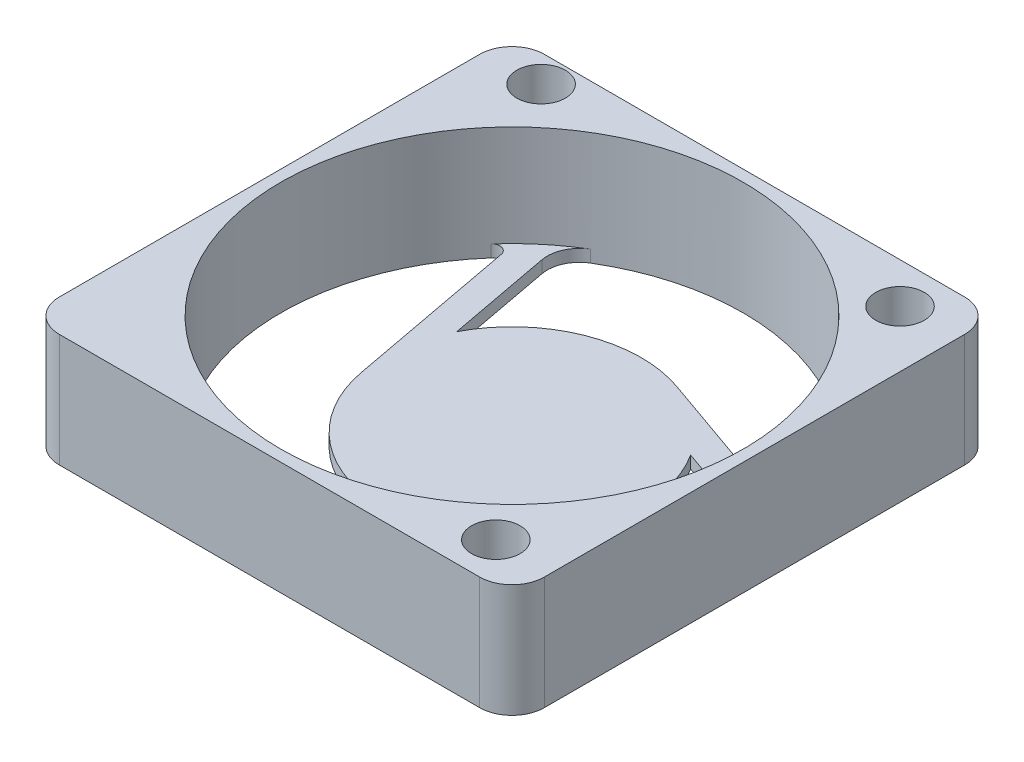
ISO-10303-21;
HEADER;
FILE_DESCRIPTION(('STEP AP214'),'2;1');
FILE_NAME('part.step','',(''),(''),'','','');
FILE_SCHEMA(('AUTOMOTIVE_DESIGN { 1 0 10303 214 1 1 1 1 }'));
ENDSEC;
DATA;
#1=APPLICATION_CONTEXT('core data for automotive mechanical design processes');
#2=APPLICATION_PROTOCOL_DEFINITION('international standard','automotive_design',2000,#1);
#3=PRODUCT_CONTEXT('',#1,'mechanical');
#4=PRODUCT('Part','Part','',(#3));
#5=PRODUCT_RELATED_PRODUCT_CATEGORY('part','',(#4));
#6=PRODUCT_DEFINITION_FORMATION('','',#4);
#7=PRODUCT_DEFINITION_CONTEXT('part definition',#1,'design');
#8=PRODUCT_DEFINITION('design','',#6,#7);
#9=PRODUCT_DEFINITION_SHAPE('','',#8);
#10=(LENGTH_UNIT() NAMED_UNIT(*) SI_UNIT(.MILLI.,.METRE.));
#11=(NAMED_UNIT(*) PLANE_ANGLE_UNIT() SI_UNIT($,.RADIAN.));
#12=(NAMED_UNIT(*) SI_UNIT($,.STERADIAN.) SOLID_ANGLE_UNIT());
#13=UNCERTAINTY_MEASURE_WITH_UNIT(LENGTH_MEASURE(1.E-05),#10,'distance_accuracy_value','');
#14=(GEOMETRIC_REPRESENTATION_CONTEXT(3) GLOBAL_UNCERTAINTY_ASSIGNED_CONTEXT((#13)) GLOBAL_UNIT_ASSIGNED_CONTEXT((#10,
#11,#12)) REPRESENTATION_CONTEXT('',''));
#15=CARTESIAN_POINT('',(0.,0.,0.));
#16=DIRECTION('',(0.,0.,1.));
#17=DIRECTION('',(1.,0.,0.));
#18=AXIS2_PLACEMENT_3D('',#15,#16,#17);
#19=CARTESIAN_POINT('',(13.,0.,13.));
#20=DIRECTION('',(0.,1.,0.));
#21=DIRECTION('',(0.,0.,1.));
#22=AXIS2_PLACEMENT_3D('',#19,#20,#21);
#23=PLANE('',#22);
#24=CARTESIAN_POINT('',(0.,0.,0.));
#25=DIRECTION('',(0.,1.,0.));
#26=DIRECTION('',(0.,0.,1.));
#27=AXIS2_PLACEMENT_3D('',#24,#25,#26);
#28=CIRCLE('',#27,8.);
#29=CARTESIAN_POINT('',(6.74049606659327,0.,-4.30879481714326));
#30=VERTEX_POINT('',#29);
#31=CARTESIAN_POINT('',(5.2099932184376,0.,6.0709118478069));
#32=VERTEX_POINT('',#31);
#33=EDGE_CURVE('E304',#30,#32,#28,.F.);
#34=ORIENTED_EDGE('',*,*,#33,.T.);
#35=DIRECTION('',(0.758863980975885,0.,-0.651249152304578));
#36=VECTOR('',#35,1.);
#37=CARTESIAN_POINT('',(5.20999321843695,0.,6.07091184780746));
#38=LINE('',#37,#36);
#39=CARTESIAN_POINT('',(-3.0400135739461,0.,13.1509816162225));
#40=VERTEX_POINT('',#39);
#41=EDGE_CURVE('E281',#40,#32,#38,.T.);
#42=ORIENTED_EDGE('',*,*,#41,.F.);
#43=CARTESIAN_POINT('',(-2.71438899779381,0.,13.5304136067105));
#44=DIRECTION('',(0.,1.,0.));
#45=DIRECTION('',(0.,0.,1.));
#46=AXIS2_PLACEMENT_3D('',#43,#44,#45);
#47=CIRCLE('',#46,0.5);
#48=CARTESIAN_POINT('',(-2.81273642525011,0.,14.0206459837652));
#49=VERTEX_POINT('',#48);
#50=EDGE_CURVE('E12',#40,#49,#47,.T.);
#51=ORIENTED_EDGE('',*,*,#50,.T.);
#52=CARTESIAN_POINT('',(0.,0.,0.));
#53=DIRECTION('',(0.,1.,0.));
#54=DIRECTION('',(0.,0.,1.));
#55=AXIS2_PLACEMENT_3D('',#52,#53,#54);
#56=CIRCLE('',#55,14.3);
#57=CARTESIAN_POINT('',(14.297372810482,0.,-0.274099832340589));
#58=VERTEX_POINT('',#57);
#59=EDGE_CURVE('E300',#58,#49,#56,.F.);
#60=ORIENTED_EDGE('',*,*,#59,.F.);
#61=CARTESIAN_POINT('',(12.2977402495755,0.,-0.235764191453794));
#62=DIRECTION('',(0.,1.,0.));
#63=DIRECTION('',(0.,0.,1.));
#64=AXIS2_PLACEMENT_3D('',#61,#62,#63);
#65=CIRCLE('',#64,2.);
#66=CARTESIAN_POINT('',(12.9608820683551,0.,-2.12262479260737));
#67=VERTEX_POINT('',#66);
#68=EDGE_CURVE('E463',#58,#67,#65,.T.);
#69=ORIENTED_EDGE('',*,*,#68,.T.);
#70=DIRECTION('',(0.943430300576788,0.,0.331570909389818));
#71=VECTOR('',#70,1.);
#72=CARTESIAN_POINT('',(2.08889672915586,0.,-5.94361089363377));
#73=LINE('',#72,#71);
#74=EDGE_CURVE('E651',#30,#67,#73,.T.);
#75=ORIENTED_EDGE('',*,*,#74,.F.);
#76=EDGE_LOOP('',(#34,#42,#51,#60,#69,#75));
#77=FACE_BOUND('',#76,.T.);
#78=CARTESIAN_POINT('',(11.5,0.,12.5));
#79=DIRECTION('',(0.,1.,0.));
#80=DIRECTION('',(0.,0.,-1.));
#81=AXIS2_PLACEMENT_3D('',#78,#79,#80);
#82=CIRCLE('',#81,1.5);
#83=CARTESIAN_POINT('',(11.5,0.,11.));
#84=VERTEX_POINT('',#83);
#85=EDGE_CURVE('E355',#84,#84,#82,.T.);
#86=ORIENTED_EDGE('',*,*,#85,.T.);
#87=EDGE_LOOP('',(#86));
#88=FACE_BOUND('',#87,.T.);
#89=CARTESIAN_POINT('',(11.5,0.,-12.5));
#90=DIRECTION('',(0.,1.,0.));
#91=DIRECTION('',(0.,0.,1.));
#92=AXIS2_PLACEMENT_3D('',#89,#90,#91);
#93=CIRCLE('',#92,1.5);
#94=CARTESIAN_POINT('',(11.5,0.,-11.));
#95=VERTEX_POINT('',#94);
#96=EDGE_CURVE('E363',#95,#95,#93,.T.);
#97=ORIENTED_EDGE('',*,*,#96,.T.);
#98=EDGE_LOOP('',(#97));
#99=FACE_BOUND('',#98,.T.);
#100=CARTESIAN_POINT('',(-11.5,0.,-13.3));
#101=DIRECTION('',(0.,1.,0.));
#102=DIRECTION('',(0.,0.,1.));
#103=AXIS2_PLACEMENT_3D('',#100,#101,#102);
#104=CIRCLE('',#103,1.5);
#105=CARTESIAN_POINT('',(-11.5,0.,-11.8));
#106=VERTEX_POINT('',#105);
#107=EDGE_CURVE('E369',#106,#106,#104,.T.);
#108=ORIENTED_EDGE('',*,*,#107,.T.);
#109=EDGE_LOOP('',(#108));
#110=FACE_BOUND('',#109,.T.);
#111=CARTESIAN_POINT('',(13.,0.,13.));
#112=DIRECTION('',(0.,1.,0.));
#113=DIRECTION('',(0.,0.,1.));
#114=AXIS2_PLACEMENT_3D('',#111,#112,#113);
#115=CIRCLE('',#114,2.);
#116=CARTESIAN_POINT('',(13.,0.,15.));
#117=VERTEX_POINT('',#116);
#118=CARTESIAN_POINT('',(15.,0.,13.));
#119=VERTEX_POINT('',#118);
#120=EDGE_CURVE('E375',#117,#119,#115,.T.);
#121=ORIENTED_EDGE('',*,*,#120,.F.);
#122=DIRECTION('',(1.,0.,0.));
#123=VECTOR('',#122,1.);
#124=CARTESIAN_POINT('',(-13.,0.,15.));
#125=LINE('',#124,#123);
#126=CARTESIAN_POINT('',(-13.,0.,15.));
#127=VERTEX_POINT('',#126);
#128=EDGE_CURVE('E382',#127,#117,#125,.T.);
#129=ORIENTED_EDGE('',*,*,#128,.F.);
#130=CARTESIAN_POINT('',(-13.,0.,13.));
#131=DIRECTION('',(0.,1.,0.));
#132=DIRECTION('',(0.,0.,-1.));
#133=AXIS2_PLACEMENT_3D('',#130,#131,#132);
#134=CIRCLE('',#133,2.);
#135=CARTESIAN_POINT('',(-15.,0.,13.));
#136=VERTEX_POINT('',#135);
#137=EDGE_CURVE('E409',#136,#127,#134,.T.);
#138=ORIENTED_EDGE('',*,*,#137,.F.);
#139=DIRECTION('',(0.,0.,1.));
#140=VECTOR('',#139,1.);
#141=CARTESIAN_POINT('',(-15.,0.,13.));
#142=LINE('',#141,#140);
#143=CARTESIAN_POINT('',(-15.,0.,-13.));
#144=VERTEX_POINT('',#143);
#145=EDGE_CURVE('E407',#144,#136,#142,.T.);
#146=ORIENTED_EDGE('',*,*,#145,.F.);
#147=CARTESIAN_POINT('',(-13.,0.,-13.));
#148=DIRECTION('',(0.,1.,0.));
#149=DIRECTION('',(0.,0.,-1.));
#150=AXIS2_PLACEMENT_3D('',#147,#148,#149);
#151=CIRCLE('',#150,2.);
#152=CARTESIAN_POINT('',(-13.,0.,-15.));
#153=VERTEX_POINT('',#152);
#154=EDGE_CURVE('E405',#153,#144,#151,.T.);
#155=ORIENTED_EDGE('',*,*,#154,.F.);
#156=DIRECTION('',(-1.,0.,0.));
#157=VECTOR('',#156,1.);
#158=CARTESIAN_POINT('',(-13.,0.,-15.));
#159=LINE('',#158,#157);
#160=CARTESIAN_POINT('',(13.,0.,-15.));
#161=VERTEX_POINT('',#160);
#162=EDGE_CURVE('E403',#161,#153,#159,.T.);
#163=ORIENTED_EDGE('',*,*,#162,.F.);
#164=CARTESIAN_POINT('',(13.,0.,-13.));
#165=DIRECTION('',(0.,1.,0.));
#166=DIRECTION('',(0.,0.,-1.));
#167=AXIS2_PLACEMENT_3D('',#164,#165,#166);
#168=CIRCLE('',#167,2.);
#169=CARTESIAN_POINT('',(15.,0.,-13.));
#170=VERTEX_POINT('',#169);
#171=EDGE_CURVE('E401',#170,#161,#168,.T.);
#172=ORIENTED_EDGE('',*,*,#171,.F.);
#173=DIRECTION('',(0.,0.,-1.));
#174=VECTOR('',#173,1.);
#175=CARTESIAN_POINT('',(15.,0.,13.));
#176=LINE('',#175,#174);
#177=EDGE_CURVE('E399',#119,#170,#176,.T.);
#178=ORIENTED_EDGE('',*,*,#177,.F.);
#179=EDGE_LOOP('',(#121,#129,#138,#146,#155,#163,#172,#178));
#180=FACE_BOUND('',#179,.T.);
#181=CARTESIAN_POINT('',(0.,0.,0.));
#182=DIRECTION('',(0.,1.,0.));
#183=DIRECTION('',(0.,0.,1.));
#184=AXIS2_PLACEMENT_3D('',#181,#182,#183);
#185=CIRCLE('',#184,8.);
#186=CARTESIAN_POINT('',(0.361277738045123,0.,7.99183823635031));
#187=VERTEX_POINT('',#186);
#188=CARTESIAN_POINT('',(-7.86256049355453,0.,1.47653055680798));
#189=VERTEX_POINT('',#188);
#190=EDGE_CURVE('E336',#187,#189,#185,.F.);
#191=ORIENTED_EDGE('',*,*,#190,.T.);
#192=DIRECTION('',(0.184566319600904,0.,0.982820061694397));
#193=VECTOR('',#192,1.);
#194=CARTESIAN_POINT('',(-7.86256049355469,0.,1.47653055680714));
#195=LINE('',#194,#193);
#196=CARTESIAN_POINT('',(-9.86907737737697,0.,-9.20821979099905));
#197=VERTEX_POINT('',#196);
#198=EDGE_CURVE('E339',#197,#189,#195,.T.);
#199=ORIENTED_EDGE('',*,*,#198,.F.);
#200=CARTESIAN_POINT('',(-10.3604874082242,0.,-9.11593663119859));
#201=DIRECTION('',(0.,1.,0.));
#202=DIRECTION('',(0.,0.,1.));
#203=AXIS2_PLACEMENT_3D('',#200,#201,#202);
#204=CIRCLE('',#203,0.5);
#205=CARTESIAN_POINT('',(-10.735867386783,0.,-9.44622419029999));
#206=VERTEX_POINT('',#205);
#207=EDGE_CURVE('E481',#197,#206,#204,.T.);
#208=ORIENTED_EDGE('',*,*,#207,.T.);
#209=CARTESIAN_POINT('',(0.,0.,0.));
#210=DIRECTION('',(0.,1.,0.));
#211=DIRECTION('',(0.,0.,1.));
#212=AXIS2_PLACEMENT_3D('',#209,#210,#211);
#213=CIRCLE('',#212,14.3);
#214=CARTESIAN_POINT('',(-6.91130898726047,0.,12.5189379774249));
#215=VERTEX_POINT('',#214);
#216=EDGE_CURVE('E329',#215,#206,#213,.F.);
#217=ORIENTED_EDGE('',*,*,#216,.F.);
#218=CARTESIAN_POINT('',(-5.94469234568558,0.,10.7680375610019));
#219=DIRECTION('',(0.,1.,0.));
#220=DIRECTION('',(0.,0.,1.));
#221=AXIS2_PLACEMENT_3D('',#218,#219,#220);
#222=CIRCLE('',#221,2.);
#223=CARTESIAN_POINT('',(-4.64219404107642,0.,12.2857655229536));
#224=VERTEX_POINT('',#223);
#225=EDGE_CURVE('E458',#215,#224,#222,.T.);
#226=ORIENTED_EDGE('',*,*,#225,.T.);
#227=DIRECTION('',(-0.758863980975885,0.,0.651249152304579));
#228=VECTOR('',#227,1.);
#229=CARTESIAN_POINT('',(4.10286965951916,0.,4.78084308014845));
#230=LINE('',#229,#228);
#231=EDGE_CURVE('E332',#187,#224,#230,.T.);
#232=ORIENTED_EDGE('',*,*,#231,.F.);
#233=EDGE_LOOP('',(#191,#199,#208,#217,#226,#232));
#234=FACE_BOUND('',#233,.T.);
#235=CARTESIAN_POINT('',(0.,0.,0.));
#236=DIRECTION('',(0.,1.,0.));
#237=DIRECTION('',(0.,0.,1.));
#238=AXIS2_PLACEMENT_3D('',#235,#236,#237);
#239=CIRCLE('',#238,8.);
#240=CARTESIAN_POINT('',(-7.10177380463679,0.,-3.68304341920648));
#241=VERTEX_POINT('',#240);
#242=CARTESIAN_POINT('',(2.65256727511854,0.,-7.5474424046143));
#243=VERTEX_POINT('',#242);
#244=EDGE_CURVE('E312',#241,#243,#239,.F.);
#245=ORIENTED_EDGE('',*,*,#244,.T.);
#246=DIRECTION('',(-0.943430300576788,0.,-0.331570909389818));
#247=VECTOR('',#246,1.);
#248=CARTESIAN_POINT('',(2.65256727511855,0.,-7.5474424046143));
#249=LINE('',#248,#247);
#250=CARTESIAN_POINT('',(12.9090909513241,0.,-3.94276182522382));
#251=VERTEX_POINT('',#250);
#252=EDGE_CURVE('E315',#251,#243,#249,.T.);
#253=ORIENTED_EDGE('',*,*,#252,.F.);
#254=CARTESIAN_POINT('',(13.074876406019,0.,-4.41447697551221));
#255=DIRECTION('',(0.,1.,0.));
#256=DIRECTION('',(0.,0.,1.));
#257=AXIS2_PLACEMENT_3D('',#254,#255,#256);
#258=CIRCLE('',#257,0.5);
#259=CARTESIAN_POINT('',(13.5486038120342,0.,-4.57442179346556));
#260=VERTEX_POINT('',#259);
#261=EDGE_CURVE('E485',#251,#260,#258,.T.);
#262=ORIENTED_EDGE('',*,*,#261,.T.);
#263=CARTESIAN_POINT('',(0.,0.,0.));
#264=DIRECTION('',(0.,1.,0.));
#265=DIRECTION('',(0.,0.,1.));
#266=AXIS2_PLACEMENT_3D('',#263,#264,#265);
#267=CIRCLE('',#266,14.3);
#268=CARTESIAN_POINT('',(-7.38606382322051,0.,-12.2448381450844));
#269=VERTEX_POINT('',#268);
#270=EDGE_CURVE('E305',#269,#260,#267,.F.);
#271=ORIENTED_EDGE('',*,*,#270,.F.);
#272=CARTESIAN_POINT('',(-6.35304790388897,0.,-10.5322733695481));
#273=DIRECTION('',(0.,1.,0.));
#274=DIRECTION('',(0.,0.,1.));
#275=AXIS2_PLACEMENT_3D('',#272,#273,#274);
#276=CIRCLE('',#275,2.);
#277=CARTESIAN_POINT('',(-8.31868802727776,0.,-10.1631407303463));
#278=VERTEX_POINT('',#277);
#279=EDGE_CURVE('E453',#269,#278,#276,.T.);
#280=ORIENTED_EDGE('',*,*,#279,.T.);
#281=DIRECTION('',(-0.184566319600904,0.,-0.982820061694396));
#282=VECTOR('',#281,1.);
#283=CARTESIAN_POINT('',(-6.19176638867421,0.,1.1627678134856));
#284=LINE('',#283,#282);
#285=EDGE_CURVE('E308',#241,#278,#284,.T.);
#286=ORIENTED_EDGE('',*,*,#285,.F.);
#287=EDGE_LOOP('',(#245,#253,#262,#271,#280,#286));
#288=FACE_BOUND('',#287,.T.);
#289=ADVANCED_FACE('F107',(#77,#88,#99,#110,#180,#234,#288),#23,.F.);
#290=CARTESIAN_POINT('',(13.,7.,13.));
#291=DIRECTION('',(0.,1.,0.));
#292=DIRECTION('',(0.,0.,1.));
#293=AXIS2_PLACEMENT_3D('',#290,#291,#292);
#294=PLANE('',#293);
#295=CARTESIAN_POINT('',(0.,7.,0.));
#296=DIRECTION('',(0.,1.,0.));
#297=DIRECTION('',(0.,0.,1.));
#298=AXIS2_PLACEMENT_3D('',#295,#296,#297);
#299=CIRCLE('',#298,14.3);
#300=CARTESIAN_POINT('',(0.,7.,14.3));
#301=VERTEX_POINT('',#300);
#302=EDGE_CURVE('E352',#301,#301,#299,.T.);
#303=ORIENTED_EDGE('',*,*,#302,.F.);
#304=EDGE_LOOP('',(#303));
#305=FACE_BOUND('',#304,.T.);
#306=CARTESIAN_POINT('',(11.5,7.,-12.5));
#307=DIRECTION('',(0.,1.,0.));
#308=DIRECTION('',(0.,0.,1.));
#309=AXIS2_PLACEMENT_3D('',#306,#307,#308);
#310=CIRCLE('',#309,1.5);
#311=CARTESIAN_POINT('',(11.5,7.,-11.));
#312=VERTEX_POINT('',#311);
#313=EDGE_CURVE('E366',#312,#312,#310,.T.);
#314=ORIENTED_EDGE('',*,*,#313,.F.);
#315=EDGE_LOOP('',(#314));
#316=FACE_BOUND('',#315,.T.);
#317=CARTESIAN_POINT('',(13.,7.,13.));
#318=DIRECTION('',(0.,1.,0.));
#319=DIRECTION('',(0.,0.,1.));
#320=AXIS2_PLACEMENT_3D('',#317,#318,#319);
#321=CIRCLE('',#320,2.);
#322=CARTESIAN_POINT('',(13.,7.,15.));
#323=VERTEX_POINT('',#322);
#324=CARTESIAN_POINT('',(15.,7.,13.));
#325=VERTEX_POINT('',#324);
#326=EDGE_CURVE('E378',#323,#325,#321,.T.);
#327=ORIENTED_EDGE('',*,*,#326,.T.);
#328=DIRECTION('',(0.,0.,-1.));
#329=VECTOR('',#328,1.);
#330=CARTESIAN_POINT('',(15.,7.,13.));
#331=LINE('',#330,#329);
#332=CARTESIAN_POINT('',(15.,7.,-13.));
#333=VERTEX_POINT('',#332);
#334=EDGE_CURVE('E381',#325,#333,#331,.T.);
#335=ORIENTED_EDGE('',*,*,#334,.T.);
#336=CARTESIAN_POINT('',(13.,7.,-13.));
#337=DIRECTION('',(0.,1.,0.));
#338=DIRECTION('',(0.,0.,-1.));
#339=AXIS2_PLACEMENT_3D('',#336,#337,#338);
#340=CIRCLE('',#339,2.);
#341=CARTESIAN_POINT('',(13.,7.,-15.));
#342=VERTEX_POINT('',#341);
#343=EDGE_CURVE('E384',#333,#342,#340,.T.);
#344=ORIENTED_EDGE('',*,*,#343,.T.);
#345=DIRECTION('',(-1.,0.,0.));
#346=VECTOR('',#345,1.);
#347=CARTESIAN_POINT('',(-13.,7.,-15.));
#348=LINE('',#347,#346);
#349=CARTESIAN_POINT('',(-13.,7.,-15.));
#350=VERTEX_POINT('',#349);
#351=EDGE_CURVE('E386',#342,#350,#348,.T.);
#352=ORIENTED_EDGE('',*,*,#351,.T.);
#353=CARTESIAN_POINT('',(-13.,7.,-13.));
#354=DIRECTION('',(0.,1.,0.));
#355=DIRECTION('',(0.,0.,-1.));
#356=AXIS2_PLACEMENT_3D('',#353,#354,#355);
#357=CIRCLE('',#356,2.);
#358=CARTESIAN_POINT('',(-15.,7.,-13.));
#359=VERTEX_POINT('',#358);
#360=EDGE_CURVE('E388',#350,#359,#357,.T.);
#361=ORIENTED_EDGE('',*,*,#360,.T.);
#362=DIRECTION('',(0.,0.,1.));
#363=VECTOR('',#362,1.);
#364=CARTESIAN_POINT('',(-15.,7.,13.));
#365=LINE('',#364,#363);
#366=CARTESIAN_POINT('',(-15.,7.,13.));
#367=VERTEX_POINT('',#366);
#368=EDGE_CURVE('E390',#359,#367,#365,.T.);
#369=ORIENTED_EDGE('',*,*,#368,.T.);
#370=CARTESIAN_POINT('',(-13.,7.,13.));
#371=DIRECTION('',(0.,1.,0.));
#372=DIRECTION('',(0.,0.,-1.));
#373=AXIS2_PLACEMENT_3D('',#370,#371,#372);
#374=CIRCLE('',#373,2.);
#375=CARTESIAN_POINT('',(-13.,7.,15.));
#376=VERTEX_POINT('',#375);
#377=EDGE_CURVE('E392',#367,#376,#374,.T.);
#378=ORIENTED_EDGE('',*,*,#377,.T.);
#379=DIRECTION('',(1.,0.,0.));
#380=VECTOR('',#379,1.);
#381=CARTESIAN_POINT('',(-13.,7.,15.));
#382=LINE('',#381,#380);
#383=EDGE_CURVE('E394',#376,#323,#382,.T.);
#384=ORIENTED_EDGE('',*,*,#383,.T.);
#385=EDGE_LOOP('',(#327,#335,#344,#352,#361,#369,#378,#384));
#386=FACE_BOUND('',#385,.T.);
#387=CARTESIAN_POINT('',(-11.5,7.,-13.3));
#388=DIRECTION('',(0.,1.,0.));
#389=DIRECTION('',(0.,0.,1.));
#390=AXIS2_PLACEMENT_3D('',#387,#388,#389);
#391=CIRCLE('',#390,1.5);
#392=CARTESIAN_POINT('',(-11.5,7.,-11.8));
#393=VERTEX_POINT('',#392);
#394=EDGE_CURVE('E372',#393,#393,#391,.T.);
#395=ORIENTED_EDGE('',*,*,#394,.F.);
#396=EDGE_LOOP('',(#395));
#397=FACE_BOUND('',#396,.T.);
#398=CARTESIAN_POINT('',(11.5,7.,12.5));
#399=DIRECTION('',(0.,1.,0.));
#400=DIRECTION('',(0.,0.,-1.));
#401=AXIS2_PLACEMENT_3D('',#398,#399,#400);
#402=CIRCLE('',#401,1.5);
#403=CARTESIAN_POINT('',(11.5,7.,11.));
#404=VERTEX_POINT('',#403);
#405=EDGE_CURVE('E360',#404,#404,#402,.T.);
#406=ORIENTED_EDGE('',*,*,#405,.F.);
#407=EDGE_LOOP('',(#406));
#408=FACE_BOUND('',#407,.T.);
#409=ADVANCED_FACE('F527',(#305,#316,#386,#397,#408),#294,.T.);
#410=CARTESIAN_POINT('',(13.,7.,13.));
#411=DIRECTION('',(0.,-1.,0.));
#412=DIRECTION('',(0.,0.,-1.));
#413=AXIS2_PLACEMENT_3D('',#410,#411,#412);
#414=CYLINDRICAL_SURFACE('',#413,2.);
#415=ORIENTED_EDGE('',*,*,#120,.T.);
#416=DIRECTION('',(0.,-1.,0.));
#417=VECTOR('',#416,1.);
#418=CARTESIAN_POINT('',(15.,7.,13.));
#419=LINE('',#418,#417);
#420=EDGE_CURVE('E432',#325,#119,#419,.T.);
#421=ORIENTED_EDGE('',*,*,#420,.F.);
#422=ORIENTED_EDGE('',*,*,#326,.F.);
#423=DIRECTION('',(0.,-1.,0.));
#424=VECTOR('',#423,1.);
#425=CARTESIAN_POINT('',(13.,7.,15.));
#426=LINE('',#425,#424);
#427=EDGE_CURVE('E396',#323,#117,#426,.T.);
#428=ORIENTED_EDGE('',*,*,#427,.T.);
#429=EDGE_LOOP('',(#415,#421,#422,#428));
#430=FACE_BOUND('',#429,.T.);
#431=ADVANCED_FACE('F533',(#430),#414,.T.);
#432=CARTESIAN_POINT('',(15.,7.,13.));
#433=DIRECTION('',(-1.,0.,0.));
#434=DIRECTION('',(0.,0.,1.));
#435=AXIS2_PLACEMENT_3D('',#432,#433,#434);
#436=PLANE('',#435);
#437=ORIENTED_EDGE('',*,*,#177,.T.);
#438=DIRECTION('',(0.,-1.,0.));
#439=VECTOR('',#438,1.);
#440=CARTESIAN_POINT('',(15.,7.,-13.));
#441=LINE('',#440,#439);
#442=EDGE_CURVE('E429',#333,#170,#441,.T.);
#443=ORIENTED_EDGE('',*,*,#442,.F.);
#444=ORIENTED_EDGE('',*,*,#334,.F.);
#445=ORIENTED_EDGE('',*,*,#420,.T.);
#446=EDGE_LOOP('',(#437,#443,#444,#445));
#447=FACE_BOUND('',#446,.T.);
#448=ADVANCED_FACE('F563',(#447),#436,.F.);
#449=CARTESIAN_POINT('',(13.,7.,-13.));
#450=DIRECTION('',(0.,-1.,0.));
#451=DIRECTION('',(0.,0.,-1.));
#452=AXIS2_PLACEMENT_3D('',#449,#450,#451);
#453=CYLINDRICAL_SURFACE('',#452,2.);
#454=ORIENTED_EDGE('',*,*,#171,.T.);
#455=DIRECTION('',(0.,-1.,0.));
#456=VECTOR('',#455,1.);
#457=CARTESIAN_POINT('',(13.,7.,-15.));
#458=LINE('',#457,#456);
#459=EDGE_CURVE('E426',#342,#161,#458,.T.);
#460=ORIENTED_EDGE('',*,*,#459,.F.);
#461=ORIENTED_EDGE('',*,*,#343,.F.);
#462=ORIENTED_EDGE('',*,*,#442,.T.);
#463=EDGE_LOOP('',(#454,#460,#461,#462));
#464=FACE_BOUND('',#463,.T.);
#465=ADVANCED_FACE('F559',(#464),#453,.T.);
#466=CARTESIAN_POINT('',(-13.,7.,-15.));
#467=DIRECTION('',(0.,0.,1.));
#468=DIRECTION('',(1.,0.,0.));
#469=AXIS2_PLACEMENT_3D('',#466,#467,#468);
#470=PLANE('',#469);
#471=ORIENTED_EDGE('',*,*,#162,.T.);
#472=DIRECTION('',(0.,-1.,0.));
#473=VECTOR('',#472,1.);
#474=CARTESIAN_POINT('',(-13.,7.,-15.));
#475=LINE('',#474,#473);
#476=EDGE_CURVE('E423',#350,#153,#475,.T.);
#477=ORIENTED_EDGE('',*,*,#476,.F.);
#478=ORIENTED_EDGE('',*,*,#351,.F.);
#479=ORIENTED_EDGE('',*,*,#459,.T.);
#480=EDGE_LOOP('',(#471,#477,#478,#479));
#481=FACE_BOUND('',#480,.T.);
#482=ADVANCED_FACE('F555',(#481),#470,.F.);
#483=CARTESIAN_POINT('',(-13.,7.,-13.));
#484=DIRECTION('',(0.,-1.,0.));
#485=DIRECTION('',(0.,0.,-1.));
#486=AXIS2_PLACEMENT_3D('',#483,#484,#485);
#487=CYLINDRICAL_SURFACE('',#486,2.);
#488=ORIENTED_EDGE('',*,*,#154,.T.);
#489=DIRECTION('',(0.,-1.,0.));
#490=VECTOR('',#489,1.);
#491=CARTESIAN_POINT('',(-15.,7.,-13.));
#492=LINE('',#491,#490);
#493=EDGE_CURVE('E420',#359,#144,#492,.T.);
#494=ORIENTED_EDGE('',*,*,#493,.F.);
#495=ORIENTED_EDGE('',*,*,#360,.F.);
#496=ORIENTED_EDGE('',*,*,#476,.T.);
#497=EDGE_LOOP('',(#488,#494,#495,#496));
#498=FACE_BOUND('',#497,.T.);
#499=ADVANCED_FACE('F551',(#498),#487,.T.);
#500=CARTESIAN_POINT('',(-15.,7.,13.));
#501=DIRECTION('',(1.,0.,0.));
#502=DIRECTION('',(0.,0.,-1.));
#503=AXIS2_PLACEMENT_3D('',#500,#501,#502);
#504=PLANE('',#503);
#505=ORIENTED_EDGE('',*,*,#145,.T.);
#506=DIRECTION('',(0.,-1.,0.));
#507=VECTOR('',#506,1.);
#508=CARTESIAN_POINT('',(-15.,7.,13.));
#509=LINE('',#508,#507);
#510=EDGE_CURVE('E417',#367,#136,#509,.T.);
#511=ORIENTED_EDGE('',*,*,#510,.F.);
#512=ORIENTED_EDGE('',*,*,#368,.F.);
#513=ORIENTED_EDGE('',*,*,#493,.T.);
#514=EDGE_LOOP('',(#505,#511,#512,#513));
#515=FACE_BOUND('',#514,.T.);
#516=ADVANCED_FACE('F547',(#515),#504,.F.);
#517=CARTESIAN_POINT('',(-13.,7.,13.));
#518=DIRECTION('',(0.,-1.,0.));
#519=DIRECTION('',(0.,0.,-1.));
#520=AXIS2_PLACEMENT_3D('',#517,#518,#519);
#521=CYLINDRICAL_SURFACE('',#520,2.);
#522=ORIENTED_EDGE('',*,*,#137,.T.);
#523=DIRECTION('',(0.,-1.,0.));
#524=VECTOR('',#523,1.);
#525=CARTESIAN_POINT('',(-13.,7.,15.));
#526=LINE('',#525,#524);
#527=EDGE_CURVE('E414',#376,#127,#526,.T.);
#528=ORIENTED_EDGE('',*,*,#527,.F.);
#529=ORIENTED_EDGE('',*,*,#377,.F.);
#530=ORIENTED_EDGE('',*,*,#510,.T.);
#531=EDGE_LOOP('',(#522,#528,#529,#530));
#532=FACE_BOUND('',#531,.T.);
#533=ADVANCED_FACE('F543',(#532),#521,.T.);
#534=CARTESIAN_POINT('',(-13.,7.,15.));
#535=DIRECTION('',(0.,0.,-1.));
#536=DIRECTION('',(-1.,0.,0.));
#537=AXIS2_PLACEMENT_3D('',#534,#535,#536);
#538=PLANE('',#537);
#539=ORIENTED_EDGE('',*,*,#128,.T.);
#540=ORIENTED_EDGE('',*,*,#427,.F.);
#541=ORIENTED_EDGE('',*,*,#383,.F.);
#542=ORIENTED_EDGE('',*,*,#527,.T.);
#543=EDGE_LOOP('',(#539,#540,#541,#542));
#544=FACE_BOUND('',#543,.T.);
#545=ADVANCED_FACE('F539',(#544),#538,.F.);
#546=CARTESIAN_POINT('',(-11.5,7.,-13.3));
#547=DIRECTION('',(0.,-1.,0.));
#548=DIRECTION('',(0.,0.,-1.));
#549=AXIS2_PLACEMENT_3D('',#546,#547,#548);
#550=CYLINDRICAL_SURFACE('',#549,1.5);
#551=ORIENTED_EDGE('',*,*,#394,.T.);
#552=EDGE_LOOP('',(#551));
#553=FACE_BOUND('',#552,.T.);
#554=ORIENTED_EDGE('',*,*,#107,.F.);
#555=EDGE_LOOP('',(#554));
#556=FACE_BOUND('',#555,.T.);
#557=ADVANCED_FACE('F542',(#553,#556),#550,.F.);
#558=CARTESIAN_POINT('',(11.5,7.,-12.5));
#559=DIRECTION('',(0.,-1.,0.));
#560=DIRECTION('',(0.,0.,-1.));
#561=AXIS2_PLACEMENT_3D('',#558,#559,#560);
#562=CYLINDRICAL_SURFACE('',#561,1.5);
#563=ORIENTED_EDGE('',*,*,#313,.T.);
#564=EDGE_LOOP('',(#563));
#565=FACE_BOUND('',#564,.T.);
#566=ORIENTED_EDGE('',*,*,#96,.F.);
#567=EDGE_LOOP('',(#566));
#568=FACE_BOUND('',#567,.T.);
#569=ADVANCED_FACE('F604',(#565,#568),#562,.F.);
#570=CARTESIAN_POINT('',(11.5,7.,12.5));
#571=DIRECTION('',(0.,-1.,0.));
#572=DIRECTION('',(0.,0.,-1.));
#573=AXIS2_PLACEMENT_3D('',#570,#571,#572);
#574=CYLINDRICAL_SURFACE('',#573,1.5);
#575=ORIENTED_EDGE('',*,*,#405,.T.);
#576=EDGE_LOOP('',(#575));
#577=FACE_BOUND('',#576,.T.);
#578=ORIENTED_EDGE('',*,*,#85,.F.);
#579=EDGE_LOOP('',(#578));
#580=FACE_BOUND('',#579,.T.);
#581=ADVANCED_FACE('F601',(#577,#580),#574,.F.);
#582=CARTESIAN_POINT('',(0.,0.75,0.));
#583=DIRECTION('',(0.,1.,0.));
#584=DIRECTION('',(0.,0.,1.));
#585=AXIS2_PLACEMENT_3D('',#582,#583,#584);
#586=CYLINDRICAL_SURFACE('',#585,14.3);
#587=ORIENTED_EDGE('',*,*,#216,.T.);
#588=DIRECTION('',(0.,1.,0.));
#589=VECTOR('',#588,1.);
#590=CARTESIAN_POINT('',(-10.735867386783,0.75,-9.44622419029999));
#591=LINE('',#590,#589);
#592=CARTESIAN_POINT('',(-10.735867386783,0.75,-9.44622419029999));
#593=VERTEX_POINT('',#592);
#594=EDGE_CURVE('E471',#206,#593,#591,.T.);
#595=ORIENTED_EDGE('',*,*,#594,.T.);
#596=CARTESIAN_POINT('',(0.,0.75,0.));
#597=DIRECTION('',(0.,1.,0.));
#598=DIRECTION('',(0.,0.,1.));
#599=AXIS2_PLACEMENT_3D('',#596,#597,#598);
#600=CIRCLE('',#599,14.3);
#601=CARTESIAN_POINT('',(-7.38606382322051,0.75,-12.2448381450844));
#602=VERTEX_POINT('',#601);
#603=EDGE_CURVE('E356',#602,#593,#600,.T.);
#604=ORIENTED_EDGE('',*,*,#603,.F.);
#605=DIRECTION('',(0.,1.,0.));
#606=VECTOR('',#605,1.);
#607=CARTESIAN_POINT('',(-7.38606382322051,0.75,-12.2448381450844));
#608=LINE('',#607,#606);
#609=EDGE_CURVE('E442',#602,#269,#608,.F.);
#610=ORIENTED_EDGE('',*,*,#609,.T.);
#611=ORIENTED_EDGE('',*,*,#270,.T.);
#612=DIRECTION('',(0.,1.,0.));
#613=VECTOR('',#612,1.);
#614=CARTESIAN_POINT('',(13.5486038120342,0.75,-4.57442179346556));
#615=LINE('',#614,#613);
#616=CARTESIAN_POINT('',(13.5486038120342,0.75,-4.57442179346556));
#617=VERTEX_POINT('',#616);
#618=EDGE_CURVE('E468',#260,#617,#615,.T.);
#619=ORIENTED_EDGE('',*,*,#618,.T.);
#620=CARTESIAN_POINT('',(14.297372810482,0.75,-0.274099832340589));
#621=VERTEX_POINT('',#620);
#622=EDGE_CURVE('E353',#621,#617,#600,.T.);
#623=ORIENTED_EDGE('',*,*,#622,.F.);
#624=DIRECTION('',(0.,1.,0.));
#625=VECTOR('',#624,1.);
#626=CARTESIAN_POINT('',(14.297372810482,0.75,-0.274099832340589));
#627=LINE('',#626,#625);
#628=EDGE_CURVE('E438',#621,#58,#627,.F.);
#629=ORIENTED_EDGE('',*,*,#628,.T.);
#630=ORIENTED_EDGE('',*,*,#59,.T.);
#631=DIRECTION('',(0.,1.,0.));
#632=VECTOR('',#631,1.);
#633=CARTESIAN_POINT('',(-2.81273642525011,0.75,14.0206459837652));
#634=LINE('',#633,#632);
#635=CARTESIAN_POINT('',(-2.81273642525011,0.75,14.0206459837652));
#636=VERTEX_POINT('',#635);
#637=EDGE_CURVE('E465',#49,#636,#634,.T.);
#638=ORIENTED_EDGE('',*,*,#637,.T.);
#639=CARTESIAN_POINT('',(-6.91130898726047,0.75,12.5189379774249));
#640=VERTEX_POINT('',#639);
#641=EDGE_CURVE('E357',#640,#636,#600,.T.);
#642=ORIENTED_EDGE('',*,*,#641,.F.);
#643=DIRECTION('',(0.,1.,0.));
#644=VECTOR('',#643,1.);
#645=CARTESIAN_POINT('',(-6.91130898726047,0.75,12.5189379774249));
#646=LINE('',#645,#644);
#647=EDGE_CURVE('E440',#640,#215,#646,.F.);
#648=ORIENTED_EDGE('',*,*,#647,.T.);
#649=EDGE_LOOP('',(#587,#595,#604,#610,#611,#619,#623,#629,#630,#638,#642,#648));
#650=FACE_BOUND('',#649,.T.);
#651=ORIENTED_EDGE('',*,*,#302,.T.);
#652=EDGE_LOOP('',(#651));
#653=FACE_BOUND('',#652,.T.);
#654=ADVANCED_FACE('F495',(#650,#653),#586,.F.);
#655=CARTESIAN_POINT('',(0.,0.75,0.));
#656=DIRECTION('',(0.,1.,0.));
#657=DIRECTION('',(0.,0.,1.));
#658=AXIS2_PLACEMENT_3D('',#655,#656,#657);
#659=PLANE('',#658);
#660=DIRECTION('',(0.943430300576788,0.,0.331570909389818));
#661=VECTOR('',#660,1.);
#662=CARTESIAN_POINT('',(2.65256727511855,0.75,-7.5474424046143));
#663=LINE('',#662,#661);
#664=CARTESIAN_POINT('',(2.65256727511854,0.75,-7.5474424046143));
#665=VERTEX_POINT('',#664);
#666=CARTESIAN_POINT('',(12.9090909513241,0.75,-3.94276182522382));
#667=VERTEX_POINT('',#666);
#668=EDGE_CURVE('E318',#665,#667,#663,.T.);
#669=ORIENTED_EDGE('',*,*,#668,.F.);
#670=CARTESIAN_POINT('',(0.,0.75,0.));
#671=DIRECTION('',(0.,1.,0.));
#672=DIRECTION('',(0.,0.,1.));
#673=AXIS2_PLACEMENT_3D('',#670,#671,#672);
#674=CIRCLE('',#673,8.);
#675=CARTESIAN_POINT('',(-7.10177380463679,0.75,-3.68304341920648));
#676=VERTEX_POINT('',#675);
#677=EDGE_CURVE('E303',#665,#676,#674,.T.);
#678=ORIENTED_EDGE('',*,*,#677,.T.);
#679=DIRECTION('',(0.184566319600904,0.,0.982820061694397));
#680=VECTOR('',#679,1.);
#681=CARTESIAN_POINT('',(-6.19176638867421,0.75,1.1627678134856));
#682=LINE('',#681,#680);
#683=CARTESIAN_POINT('',(-8.31868802727776,0.75,-10.1631407303463));
#684=VERTEX_POINT('',#683);
#685=EDGE_CURVE('E321',#684,#676,#682,.T.);
#686=ORIENTED_EDGE('',*,*,#685,.F.);
#687=CARTESIAN_POINT('',(-6.35304790388897,0.75,-10.5322733695481));
#688=DIRECTION('',(0.,1.,0.));
#689=DIRECTION('',(0.,0.,1.));
#690=AXIS2_PLACEMENT_3D('',#687,#688,#689);
#691=CIRCLE('',#690,2.);
#692=EDGE_CURVE('E450',#684,#602,#691,.F.);
#693=ORIENTED_EDGE('',*,*,#692,.T.);
#694=ORIENTED_EDGE('',*,*,#603,.T.);
#695=CARTESIAN_POINT('',(-10.3604874082242,0.75,-9.11593663119859));
#696=DIRECTION('',(0.,1.,0.));
#697=DIRECTION('',(0.,0.,1.));
#698=AXIS2_PLACEMENT_3D('',#695,#696,#697);
#699=CIRCLE('',#698,0.5);
#700=CARTESIAN_POINT('',(-9.86907737737697,0.75,-9.20821979099905));
#701=VERTEX_POINT('',#700);
#702=EDGE_CURVE('E479',#593,#701,#699,.F.);
#703=ORIENTED_EDGE('',*,*,#702,.T.);
#704=DIRECTION('',(-0.184566319600904,0.,-0.982820061694396));
#705=VECTOR('',#704,1.);
#706=CARTESIAN_POINT('',(-7.86256049355469,0.75,1.47653055680714));
#707=LINE('',#706,#705);
#708=CARTESIAN_POINT('',(-7.86256049355453,0.75,1.47653055680798));
#709=VERTEX_POINT('',#708);
#710=EDGE_CURVE('E342',#709,#701,#707,.T.);
#711=ORIENTED_EDGE('',*,*,#710,.F.);
#712=CARTESIAN_POINT('',(0.,0.75,0.));
#713=DIRECTION('',(0.,1.,0.));
#714=DIRECTION('',(0.,0.,1.));
#715=AXIS2_PLACEMENT_3D('',#712,#713,#714);
#716=CIRCLE('',#715,8.);
#717=CARTESIAN_POINT('',(0.361277738045122,0.75,7.99183823635031));
#718=VERTEX_POINT('',#717);
#719=EDGE_CURVE('E328',#709,#718,#716,.T.);
#720=ORIENTED_EDGE('',*,*,#719,.T.);
#721=DIRECTION('',(0.758863980975885,0.,-0.651249152304579));
#722=VECTOR('',#721,1.);
#723=CARTESIAN_POINT('',(4.10286965951916,0.75,4.78084308014845));
#724=LINE('',#723,#722);
#725=CARTESIAN_POINT('',(-4.64219404107643,0.75,12.2857655229536));
#726=VERTEX_POINT('',#725);
#727=EDGE_CURVE('E345',#726,#718,#724,.T.);
#728=ORIENTED_EDGE('',*,*,#727,.F.);
#729=CARTESIAN_POINT('',(-5.94469234568558,0.75,10.7680375610019));
#730=DIRECTION('',(0.,1.,0.));
#731=DIRECTION('',(0.,0.,1.));
#732=AXIS2_PLACEMENT_3D('',#729,#730,#731);
#733=CIRCLE('',#732,2.);
#734=EDGE_CURVE('E455',#726,#640,#733,.F.);
#735=ORIENTED_EDGE('',*,*,#734,.T.);
#736=ORIENTED_EDGE('',*,*,#641,.T.);
#737=CARTESIAN_POINT('',(-2.71438899779381,0.75,13.5304136067105));
#738=DIRECTION('',(0.,1.,0.));
#739=DIRECTION('',(0.,0.,1.));
#740=AXIS2_PLACEMENT_3D('',#737,#738,#739);
#741=CIRCLE('',#740,0.5);
#742=CARTESIAN_POINT('',(-3.0400135739461,0.75,13.1509816162225));
#743=VERTEX_POINT('',#742);
#744=EDGE_CURVE('E115',#636,#743,#741,.F.);
#745=ORIENTED_EDGE('',*,*,#744,.T.);
#746=DIRECTION('',(-0.758863980975885,0.,0.651249152304578));
#747=VECTOR('',#746,1.);
#748=CARTESIAN_POINT('',(5.20999321843695,0.75,6.07091184780746));
#749=LINE('',#748,#747);
#750=CARTESIAN_POINT('',(5.2099932184376,0.75,6.0709118478069));
#751=VERTEX_POINT('',#750);
#752=EDGE_CURVE('E280',#751,#743,#749,.T.);
#753=ORIENTED_EDGE('',*,*,#752,.F.);
#754=CARTESIAN_POINT('',(0.,0.75,0.));
#755=DIRECTION('',(0.,1.,0.));
#756=DIRECTION('',(0.,0.,1.));
#757=AXIS2_PLACEMENT_3D('',#754,#755,#756);
#758=CIRCLE('',#757,8.);
#759=CARTESIAN_POINT('',(6.74049606659327,0.75,-4.30879481714326));
#760=VERTEX_POINT('',#759);
#761=EDGE_CURVE('E289',#751,#760,#758,.T.);
#762=ORIENTED_EDGE('',*,*,#761,.T.);
#763=DIRECTION('',(-0.943430300576788,0.,-0.331570909389818));
#764=VECTOR('',#763,1.);
#765=CARTESIAN_POINT('',(2.08889672915586,0.75,-5.94361089363377));
#766=LINE('',#765,#764);
#767=CARTESIAN_POINT('',(12.9608820683551,0.75,-2.12262479260737));
#768=VERTEX_POINT('',#767);
#769=EDGE_CURVE('E285',#768,#760,#766,.T.);
#770=ORIENTED_EDGE('',*,*,#769,.F.);
#771=CARTESIAN_POINT('',(12.2977402495755,0.75,-0.235764191453794));
#772=DIRECTION('',(0.,1.,0.));
#773=DIRECTION('',(0.,0.,1.));
#774=AXIS2_PLACEMENT_3D('',#771,#772,#773);
#775=CIRCLE('',#774,2.);
#776=EDGE_CURVE('E460',#768,#621,#775,.F.);
#777=ORIENTED_EDGE('',*,*,#776,.T.);
#778=ORIENTED_EDGE('',*,*,#622,.T.);
#779=CARTESIAN_POINT('',(13.074876406019,0.75,-4.41447697551221));
#780=DIRECTION('',(0.,1.,0.));
#781=DIRECTION('',(0.,0.,1.));
#782=AXIS2_PLACEMENT_3D('',#779,#780,#781);
#783=CIRCLE('',#782,0.5);
#784=EDGE_CURVE('E483',#617,#667,#783,.F.);
#785=ORIENTED_EDGE('',*,*,#784,.T.);
#786=EDGE_LOOP('',(#669,#678,#686,#693,#694,#703,#711,#720,#728,#735,#736,#745,#753,#762,#770,
#777,#778,#785));
#787=FACE_BOUND('',#786,.T.);
#788=ADVANCED_FACE('F295',(#787),#659,.T.);
#789=CARTESIAN_POINT('',(0.,-27.5407190147598,0.));
#790=DIRECTION('',(0.,1.,0.));
#791=DIRECTION('',(0.,0.,1.));
#792=AXIS2_PLACEMENT_3D('',#789,#790,#791);
#793=CYLINDRICAL_SURFACE('',#792,8.);
#794=DIRECTION('',(0.,1.,0.));
#795=VECTOR('',#794,1.);
#796=CARTESIAN_POINT('',(0.361277738045122,-27.5407190147598,7.99183823635031));
#797=LINE('',#796,#795);
#798=EDGE_CURVE('E333',#187,#718,#797,.T.);
#799=ORIENTED_EDGE('',*,*,#798,.T.);
#800=ORIENTED_EDGE('',*,*,#719,.F.);
#801=DIRECTION('',(0.,1.,0.));
#802=VECTOR('',#801,1.);
#803=CARTESIAN_POINT('',(-7.86256049355453,-27.5407190147598,1.47653055680798));
#804=LINE('',#803,#802);
#805=EDGE_CURVE('E347',#189,#709,#804,.T.);
#806=ORIENTED_EDGE('',*,*,#805,.F.);
#807=ORIENTED_EDGE('',*,*,#190,.F.);
#808=EDGE_LOOP('',(#799,#800,#806,#807));
#809=FACE_BOUND('',#808,.T.);
#810=ADVANCED_FACE('F624',(#809),#793,.T.);
#811=CARTESIAN_POINT('',(4.10286965951916,-27.5407190147598,4.78084308014845));
#812=DIRECTION('',(0.651249152304579,0.,0.758863980975885));
#813=DIRECTION('',(0.758863980975885,0.,-0.651249152304579));
#814=AXIS2_PLACEMENT_3D('',#811,#812,#813);
#815=PLANE('',#814);
#816=ORIENTED_EDGE('',*,*,#231,.T.);
#817=DIRECTION('',(0.,-1.,0.));
#818=VECTOR('',#817,1.);
#819=CARTESIAN_POINT('',(-4.64219404107642,0.75,12.2857655229536));
#820=LINE('',#819,#818);
#821=EDGE_CURVE('E444',#224,#726,#820,.F.);
#822=ORIENTED_EDGE('',*,*,#821,.T.);
#823=ORIENTED_EDGE('',*,*,#727,.T.);
#824=ORIENTED_EDGE('',*,*,#798,.F.);
#825=EDGE_LOOP('',(#816,#822,#823,#824));
#826=FACE_BOUND('',#825,.T.);
#827=ADVANCED_FACE('F627',(#826),#815,.F.);
#828=CARTESIAN_POINT('',(-7.86256049355469,-27.5407190147598,1.47653055680714));
#829=DIRECTION('',(0.982820061694396,0.,-0.184566319600904));
#830=DIRECTION('',(-0.184566319600904,0.,-0.982820061694397));
#831=AXIS2_PLACEMENT_3D('',#828,#829,#830);
#832=PLANE('',#831);
#833=ORIENTED_EDGE('',*,*,#710,.T.);
#834=DIRECTION('',(0.,-1.,0.));
#835=VECTOR('',#834,1.);
#836=CARTESIAN_POINT('',(-9.86907737737697,0.,-9.20821979099905));
#837=LINE('',#836,#835);
#838=EDGE_CURVE('E474',#701,#197,#837,.T.);
#839=ORIENTED_EDGE('',*,*,#838,.T.);
#840=ORIENTED_EDGE('',*,*,#198,.T.);
#841=ORIENTED_EDGE('',*,*,#805,.T.);
#842=EDGE_LOOP('',(#833,#839,#840,#841));
#843=FACE_BOUND('',#842,.T.);
#844=ADVANCED_FACE('F629',(#843),#832,.F.);
#845=CARTESIAN_POINT('',(0.,-27.5407190147598,0.));
#846=DIRECTION('',(0.,1.,0.));
#847=DIRECTION('',(0.,0.,1.));
#848=AXIS2_PLACEMENT_3D('',#845,#846,#847);
#849=CYLINDRICAL_SURFACE('',#848,8.);
#850=DIRECTION('',(0.,1.,0.));
#851=VECTOR('',#850,1.);
#852=CARTESIAN_POINT('',(6.74049606659327,-27.5407190147598,-4.30879481714326));
#853=LINE('',#852,#851);
#854=EDGE_CURVE('E284',#30,#760,#853,.T.);
#855=ORIENTED_EDGE('',*,*,#854,.T.);
#856=ORIENTED_EDGE('',*,*,#761,.F.);
#857=DIRECTION('',(0.,1.,0.));
#858=VECTOR('',#857,1.);
#859=CARTESIAN_POINT('',(5.2099932184376,-27.5407190147598,6.0709118478069));
#860=LINE('',#859,#858);
#861=EDGE_CURVE('E277',#32,#751,#860,.T.);
#862=ORIENTED_EDGE('',*,*,#861,.F.);
#863=ORIENTED_EDGE('',*,*,#33,.F.);
#864=EDGE_LOOP('',(#855,#856,#862,#863));
#865=FACE_BOUND('',#864,.T.);
#866=ADVANCED_FACE('F290',(#865),#849,.T.);
#867=CARTESIAN_POINT('',(2.08889672915586,-27.5407190147598,-5.94361089363377));
#868=DIRECTION('',(0.331570909389818,0.,-0.943430300576788));
#869=DIRECTION('',(-0.943430300576788,0.,-0.331570909389818));
#870=AXIS2_PLACEMENT_3D('',#867,#868,#869);
#871=PLANE('',#870);
#872=ORIENTED_EDGE('',*,*,#74,.T.);
#873=DIRECTION('',(0.,-1.,0.));
#874=VECTOR('',#873,1.);
#875=CARTESIAN_POINT('',(12.9608820683551,0.75,-2.12262479260737));
#876=LINE('',#875,#874);
#877=EDGE_CURVE('E447',#67,#768,#876,.F.);
#878=ORIENTED_EDGE('',*,*,#877,.T.);
#879=ORIENTED_EDGE('',*,*,#769,.T.);
#880=ORIENTED_EDGE('',*,*,#854,.F.);
#881=EDGE_LOOP('',(#872,#878,#879,#880));
#882=FACE_BOUND('',#881,.T.);
#883=ADVANCED_FACE('F642',(#882),#871,.F.);
#884=CARTESIAN_POINT('',(5.20999321843695,-27.5407190147598,6.07091184780746));
#885=DIRECTION('',(-0.651249152304578,0.,-0.758863980975885));
#886=DIRECTION('',(-0.758863980975885,0.,0.651249152304578));
#887=AXIS2_PLACEMENT_3D('',#884,#885,#886);
#888=PLANE('',#887);
#889=ORIENTED_EDGE('',*,*,#752,.T.);
#890=DIRECTION('',(0.,-1.,0.));
#891=VECTOR('',#890,1.);
#892=CARTESIAN_POINT('',(-3.0400135739461,0.,13.1509816162225));
#893=LINE('',#892,#891);
#894=EDGE_CURVE('E128',#743,#40,#893,.T.);
#895=ORIENTED_EDGE('',*,*,#894,.T.);
#896=ORIENTED_EDGE('',*,*,#41,.T.);
#897=ORIENTED_EDGE('',*,*,#861,.T.);
#898=EDGE_LOOP('',(#889,#895,#896,#897));
#899=FACE_BOUND('',#898,.T.);
#900=ADVANCED_FACE('F279',(#899),#888,.F.);
#901=CARTESIAN_POINT('',(0.,-27.5407190147598,0.));
#902=DIRECTION('',(0.,1.,0.));
#903=DIRECTION('',(0.,0.,1.));
#904=AXIS2_PLACEMENT_3D('',#901,#902,#903);
#905=CYLINDRICAL_SURFACE('',#904,8.);
#906=DIRECTION('',(0.,1.,0.));
#907=VECTOR('',#906,1.);
#908=CARTESIAN_POINT('',(-7.10177380463679,-27.5407190147598,-3.68304341920648));
#909=LINE('',#908,#907);
#910=EDGE_CURVE('E309',#241,#676,#909,.T.);
#911=ORIENTED_EDGE('',*,*,#910,.T.);
#912=ORIENTED_EDGE('',*,*,#677,.F.);
#913=DIRECTION('',(0.,1.,0.));
#914=VECTOR('',#913,1.);
#915=CARTESIAN_POINT('',(2.65256727511854,-27.5407190147598,-7.5474424046143));
#916=LINE('',#915,#914);
#917=EDGE_CURVE('E323',#243,#665,#916,.T.);
#918=ORIENTED_EDGE('',*,*,#917,.F.);
#919=ORIENTED_EDGE('',*,*,#244,.F.);
#920=EDGE_LOOP('',(#911,#912,#918,#919));
#921=FACE_BOUND('',#920,.T.);
#922=ADVANCED_FACE('F505',(#921),#905,.T.);
#923=CARTESIAN_POINT('',(-6.19176638867421,-27.5407190147598,1.1627678134856));
#924=DIRECTION('',(-0.982820061694396,0.,0.184566319600904));
#925=DIRECTION('',(0.184566319600904,0.,0.982820061694396));
#926=AXIS2_PLACEMENT_3D('',#923,#924,#925);
#927=PLANE('',#926);
#928=ORIENTED_EDGE('',*,*,#285,.T.);
#929=DIRECTION('',(0.,-1.,0.));
#930=VECTOR('',#929,1.);
#931=CARTESIAN_POINT('',(-8.31868802727776,0.75,-10.1631407303463));
#932=LINE('',#931,#930);
#933=EDGE_CURVE('E435',#278,#684,#932,.F.);
#934=ORIENTED_EDGE('',*,*,#933,.T.);
#935=ORIENTED_EDGE('',*,*,#685,.T.);
#936=ORIENTED_EDGE('',*,*,#910,.F.);
#937=EDGE_LOOP('',(#928,#934,#935,#936));
#938=FACE_BOUND('',#937,.T.);
#939=ADVANCED_FACE('F509',(#938),#927,.F.);
#940=CARTESIAN_POINT('',(2.65256727511855,-27.5407190147598,-7.5474424046143));
#941=DIRECTION('',(-0.331570909389818,0.,0.943430300576788));
#942=DIRECTION('',(0.943430300576788,0.,0.331570909389818));
#943=AXIS2_PLACEMENT_3D('',#940,#941,#942);
#944=PLANE('',#943);
#945=ORIENTED_EDGE('',*,*,#668,.T.);
#946=DIRECTION('',(0.,-1.,0.));
#947=VECTOR('',#946,1.);
#948=CARTESIAN_POINT('',(12.9090909513241,0.,-3.94276182522382));
#949=LINE('',#948,#947);
#950=EDGE_CURVE('E476',#667,#251,#949,.T.);
#951=ORIENTED_EDGE('',*,*,#950,.T.);
#952=ORIENTED_EDGE('',*,*,#252,.T.);
#953=ORIENTED_EDGE('',*,*,#917,.T.);
#954=EDGE_LOOP('',(#945,#951,#952,#953));
#955=FACE_BOUND('',#954,.T.);
#956=ADVANCED_FACE('F501',(#955),#944,.F.);
#957=CARTESIAN_POINT('',(-6.35304790388897,0.75,-10.5322733695481));
#958=DIRECTION('',(0.,1.,0.));
#959=DIRECTION('',(0.,0.,1.));
#960=AXIS2_PLACEMENT_3D('',#957,#958,#959);
#961=CYLINDRICAL_SURFACE('',#960,2.);
#962=ORIENTED_EDGE('',*,*,#279,.F.);
#963=ORIENTED_EDGE('',*,*,#609,.F.);
#964=ORIENTED_EDGE('',*,*,#692,.F.);
#965=ORIENTED_EDGE('',*,*,#933,.F.);
#966=EDGE_LOOP('',(#962,#963,#964,#965));
#967=FACE_BOUND('',#966,.T.);
#968=ADVANCED_FACE('F513',(#967),#961,.F.);
#969=CARTESIAN_POINT('',(-5.94469234568558,0.75,10.7680375610019));
#970=DIRECTION('',(0.,1.,0.));
#971=DIRECTION('',(0.,0.,1.));
#972=AXIS2_PLACEMENT_3D('',#969,#970,#971);
#973=CYLINDRICAL_SURFACE('',#972,2.);
#974=ORIENTED_EDGE('',*,*,#225,.F.);
#975=ORIENTED_EDGE('',*,*,#647,.F.);
#976=ORIENTED_EDGE('',*,*,#734,.F.);
#977=ORIENTED_EDGE('',*,*,#821,.F.);
#978=EDGE_LOOP('',(#974,#975,#976,#977));
#979=FACE_BOUND('',#978,.T.);
#980=ADVANCED_FACE('F515',(#979),#973,.F.);
#981=CARTESIAN_POINT('',(12.2977402495755,0.75,-0.235764191453794));
#982=DIRECTION('',(0.,1.,0.));
#983=DIRECTION('',(0.,0.,1.));
#984=AXIS2_PLACEMENT_3D('',#981,#982,#983);
#985=CYLINDRICAL_SURFACE('',#984,2.);
#986=ORIENTED_EDGE('',*,*,#68,.F.);
#987=ORIENTED_EDGE('',*,*,#628,.F.);
#988=ORIENTED_EDGE('',*,*,#776,.F.);
#989=ORIENTED_EDGE('',*,*,#877,.F.);
#990=EDGE_LOOP('',(#986,#987,#988,#989));
#991=FACE_BOUND('',#990,.T.);
#992=ADVANCED_FACE('F521',(#991),#985,.F.);
#993=CARTESIAN_POINT('',(-10.3604874082242,0.75,-9.11593663119859));
#994=DIRECTION('',(0.,1.,0.));
#995=DIRECTION('',(0.,0.,1.));
#996=AXIS2_PLACEMENT_3D('',#993,#994,#995);
#997=CYLINDRICAL_SURFACE('',#996,0.5);
#998=ORIENTED_EDGE('',*,*,#207,.F.);
#999=ORIENTED_EDGE('',*,*,#838,.F.);
#1000=ORIENTED_EDGE('',*,*,#702,.F.);
#1001=ORIENTED_EDGE('',*,*,#594,.F.);
#1002=EDGE_LOOP('',(#998,#999,#1000,#1001));
#1003=FACE_BOUND('',#1002,.T.);
#1004=ADVANCED_FACE('F678',(#1003),#997,.F.);
#1005=CARTESIAN_POINT('',(13.074876406019,0.75,-4.41447697551221));
#1006=DIRECTION('',(0.,1.,0.));
#1007=DIRECTION('',(0.,0.,1.));
#1008=AXIS2_PLACEMENT_3D('',#1005,#1006,#1007);
#1009=CYLINDRICAL_SURFACE('',#1008,0.5);
#1010=ORIENTED_EDGE('',*,*,#261,.F.);
#1011=ORIENTED_EDGE('',*,*,#950,.F.);
#1012=ORIENTED_EDGE('',*,*,#784,.F.);
#1013=ORIENTED_EDGE('',*,*,#618,.F.);
#1014=EDGE_LOOP('',(#1010,#1011,#1012,#1013));
#1015=FACE_BOUND('',#1014,.T.);
#1016=ADVANCED_FACE('F499',(#1015),#1009,.F.);
#1017=CARTESIAN_POINT('',(-2.71438899779381,0.75,13.5304136067105));
#1018=DIRECTION('',(0.,1.,0.));
#1019=DIRECTION('',(0.,0.,1.));
#1020=AXIS2_PLACEMENT_3D('',#1017,#1018,#1019);
#1021=CYLINDRICAL_SURFACE('',#1020,0.5);
#1022=ORIENTED_EDGE('',*,*,#50,.F.);
#1023=ORIENTED_EDGE('',*,*,#894,.F.);
#1024=ORIENTED_EDGE('',*,*,#744,.F.);
#1025=ORIENTED_EDGE('',*,*,#637,.F.);
#1026=EDGE_LOOP('',(#1022,#1023,#1024,#1025));
#1027=FACE_BOUND('',#1026,.T.);
#1028=ADVANCED_FACE('F109',(#1027),#1021,.F.);
#1029=CLOSED_SHELL('',(#289,#409,#431,#448,#465,#482,#499,#516,#533,#545,#557,#569,#581,#654,
#788,#810,#827,#844,#866,#883,#900,#922,#939,#956,#968,#980,#992,#1004,#1016,#1028));
#1030=MANIFOLD_SOLID_BREP('B2',#1029);
#1031=ADVANCED_BREP_SHAPE_REPRESENTATION('',(#18,#1030),#14);
#1032=SHAPE_DEFINITION_REPRESENTATION(#9,#1031);
ENDSEC;
END-ISO-10303-21;
